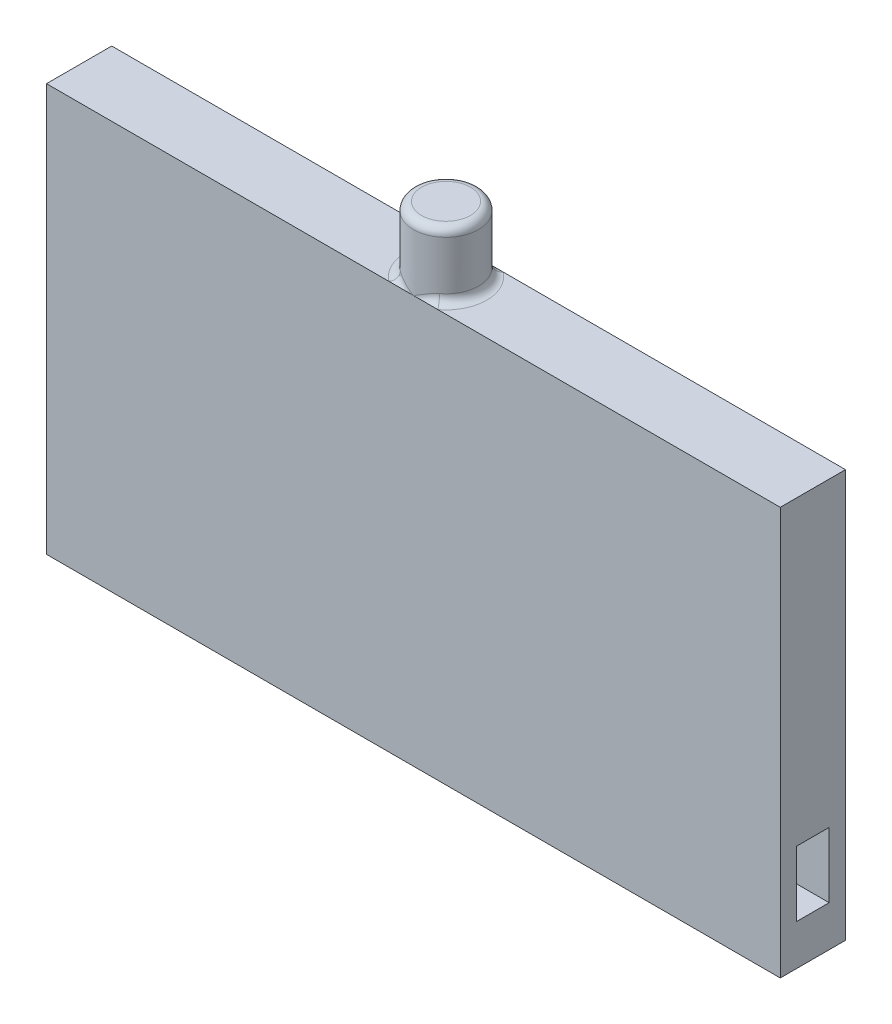
ISO-10303-21;
HEADER;
FILE_DESCRIPTION(('STEP AP214'),'2;1');
FILE_NAME('part.step','',(''),(''),'','','');
FILE_SCHEMA(('AUTOMOTIVE_DESIGN { 1 0 10303 214 1 1 1 1 }'));
ENDSEC;
DATA;
#1=APPLICATION_CONTEXT('core data for automotive mechanical design processes');
#2=APPLICATION_PROTOCOL_DEFINITION('international standard','automotive_design',2000,#1);
#3=PRODUCT_CONTEXT('',#1,'mechanical');
#4=PRODUCT('Part','Part','',(#3));
#5=PRODUCT_RELATED_PRODUCT_CATEGORY('part','',(#4));
#6=PRODUCT_DEFINITION_FORMATION('','',#4);
#7=PRODUCT_DEFINITION_CONTEXT('part definition',#1,'design');
#8=PRODUCT_DEFINITION('design','',#6,#7);
#9=PRODUCT_DEFINITION_SHAPE('','',#8);
#10=(LENGTH_UNIT() NAMED_UNIT(*) SI_UNIT(.MILLI.,.METRE.));
#11=(NAMED_UNIT(*) PLANE_ANGLE_UNIT() SI_UNIT($,.RADIAN.));
#12=(NAMED_UNIT(*) SI_UNIT($,.STERADIAN.) SOLID_ANGLE_UNIT());
#13=UNCERTAINTY_MEASURE_WITH_UNIT(LENGTH_MEASURE(1.E-05),#10,'distance_accuracy_value','');
#14=(GEOMETRIC_REPRESENTATION_CONTEXT(3) GLOBAL_UNCERTAINTY_ASSIGNED_CONTEXT((#13)) GLOBAL_UNIT_ASSIGNED_CONTEXT((#10,
#11,#12)) REPRESENTATION_CONTEXT('',''));
#15=CARTESIAN_POINT('',(0.,0.,0.));
#16=DIRECTION('',(0.,0.,1.));
#17=DIRECTION('',(1.,0.,0.));
#18=AXIS2_PLACEMENT_3D('',#15,#16,#17);
#19=CARTESIAN_POINT('',(0.,12.7,0.));
#20=DIRECTION('',(0.,-1.,0.));
#21=DIRECTION('',(0.,0.,-1.));
#22=AXIS2_PLACEMENT_3D('',#19,#20,#21);
#23=PLANE('',#22);
#24=DIRECTION('',(-1.,0.,0.));
#25=VECTOR('',#24,1.);
#26=CARTESIAN_POINT('',(-9.906,12.7,-15.7398333107177));
#27=LINE('',#26,#25);
#28=CARTESIAN_POINT('',(12.954,12.7,-15.7398333107177));
#29=VERTEX_POINT('',#28);
#30=CARTESIAN_POINT('',(2.286,12.7,-15.7398333107177));
#31=VERTEX_POINT('',#30);
#32=EDGE_CURVE('E192',#29,#31,#27,.T.);
#33=ORIENTED_EDGE('',*,*,#32,.T.);
#34=CARTESIAN_POINT('',(1.524,12.7,-14.7238333107177));
#35=DIRECTION('',(0.,-1.,0.));
#36=DIRECTION('',(0.,0.,-1.));
#37=AXIS2_PLACEMENT_3D('',#34,#35,#36);
#38=CIRCLE('',#37,1.27);
#39=CARTESIAN_POINT('',(2.286,12.7,-13.7078333107177));
#40=VERTEX_POINT('',#39);
#41=EDGE_CURVE('E11',#31,#40,#38,.T.);
#42=ORIENTED_EDGE('',*,*,#41,.T.);
#43=DIRECTION('',(1.,0.,0.));
#44=VECTOR('',#43,1.);
#45=CARTESIAN_POINT('',(-9.906,12.7,-13.7078333107177));
#46=LINE('',#45,#44);
#47=CARTESIAN_POINT('',(12.954,12.7,-13.7078333107177));
#48=VERTEX_POINT('',#47);
#49=EDGE_CURVE('E182',#40,#48,#46,.T.);
#50=ORIENTED_EDGE('',*,*,#49,.T.);
#51=DIRECTION('',(0.,0.,-1.));
#52=VECTOR('',#51,1.);
#53=CARTESIAN_POINT('',(12.954,12.7,-13.7078333107177));
#54=LINE('',#53,#52);
#55=EDGE_CURVE('E187',#48,#29,#54,.T.);
#56=ORIENTED_EDGE('',*,*,#55,.T.);
#57=EDGE_LOOP('',(#33,#42,#50,#56));
#58=FACE_BOUND('',#57,.T.);
#59=ADVANCED_FACE('F38',(#58),#23,.F.);
#60=CARTESIAN_POINT('',(-9.906,12.7,-13.7078333107177));
#61=DIRECTION('',(1.,0.,0.));
#62=DIRECTION('',(0.,0.,-1.));
#63=AXIS2_PLACEMENT_3D('',#60,#61,#62);
#64=PLANE('',#63);
#65=DIRECTION('',(0.,0.,1.));
#66=VECTOR('',#65,1.);
#67=CARTESIAN_POINT('',(-9.906,0.,-13.7078333107177));
#68=LINE('',#67,#66);
#69=CARTESIAN_POINT('',(-9.906,0.,-15.7398333107177));
#70=VERTEX_POINT('',#69);
#71=CARTESIAN_POINT('',(-9.906,0.,-13.7078333107177));
#72=VERTEX_POINT('',#71);
#73=EDGE_CURVE('E196',#70,#72,#68,.T.);
#74=ORIENTED_EDGE('',*,*,#73,.T.);
#75=DIRECTION('',(0.,-1.,0.));
#76=VECTOR('',#75,1.);
#77=CARTESIAN_POINT('',(-9.906,12.7,-13.7078333107177));
#78=LINE('',#77,#76);
#79=CARTESIAN_POINT('',(-9.906,12.7,-13.7078333107177));
#80=VERTEX_POINT('',#79);
#81=EDGE_CURVE('E213',#80,#72,#78,.T.);
#82=ORIENTED_EDGE('',*,*,#81,.F.);
#83=DIRECTION('',(0.,0.,1.));
#84=VECTOR('',#83,1.);
#85=CARTESIAN_POINT('',(-9.906,12.7,-13.7078333107177));
#86=LINE('',#85,#84);
#87=CARTESIAN_POINT('',(-9.906,12.7,-15.7398333107177));
#88=VERTEX_POINT('',#87);
#89=EDGE_CURVE('E179',#88,#80,#86,.T.);
#90=ORIENTED_EDGE('',*,*,#89,.F.);
#91=DIRECTION('',(0.,-1.,0.));
#92=VECTOR('',#91,1.);
#93=CARTESIAN_POINT('',(-9.906,12.7,-15.7398333107177));
#94=LINE('',#93,#92);
#95=EDGE_CURVE('E194',#88,#70,#94,.T.);
#96=ORIENTED_EDGE('',*,*,#95,.T.);
#97=EDGE_LOOP('',(#74,#82,#90,#96));
#98=FACE_BOUND('',#97,.T.);
#99=ADVANCED_FACE('F290',(#98),#64,.F.);
#100=CARTESIAN_POINT('',(-9.906,12.7,-13.7078333107177));
#101=DIRECTION('',(0.,0.,-1.));
#102=DIRECTION('',(-1.,0.,0.));
#103=AXIS2_PLACEMENT_3D('',#100,#101,#102);
#104=PLANE('',#103);
#105=DIRECTION('',(1.,0.,0.));
#106=VECTOR('',#105,1.);
#107=CARTESIAN_POINT('',(-9.906,0.,-13.7078333107177));
#108=LINE('',#107,#106);
#109=CARTESIAN_POINT('',(12.954,0.,-13.7078333107177));
#110=VERTEX_POINT('',#109);
#111=EDGE_CURVE('E199',#72,#110,#108,.T.);
#112=ORIENTED_EDGE('',*,*,#111,.T.);
#113=DIRECTION('',(0.,-1.,0.));
#114=VECTOR('',#113,1.);
#115=CARTESIAN_POINT('',(12.954,12.7,-13.7078333107177));
#116=LINE('',#115,#114);
#117=EDGE_CURVE('E210',#48,#110,#116,.T.);
#118=ORIENTED_EDGE('',*,*,#117,.F.);
#119=ORIENTED_EDGE('',*,*,#49,.F.);
#120=CARTESIAN_POINT('',(1.524,12.7,-13.7078333107177));
#121=VERTEX_POINT('',#120);
#122=EDGE_CURVE('E189',#121,#40,#46,.T.);
#123=ORIENTED_EDGE('',*,*,#122,.F.);
#124=CARTESIAN_POINT('',(0.762000000000002,12.7,-13.7078333107177));
#125=VERTEX_POINT('',#124);
#126=EDGE_CURVE('E188',#125,#121,#46,.T.);
#127=ORIENTED_EDGE('',*,*,#126,.F.);
#128=EDGE_CURVE('E184',#80,#125,#46,.T.);
#129=ORIENTED_EDGE('',*,*,#128,.F.);
#130=ORIENTED_EDGE('',*,*,#81,.T.);
#131=EDGE_LOOP('',(#112,#118,#119,#123,#127,#129,#130));
#132=FACE_BOUND('',#131,.T.);
#133=ADVANCED_FACE('F286',(#132),#104,.F.);
#134=CARTESIAN_POINT('',(12.954,12.7,-13.7078333107177));
#135=DIRECTION('',(-1.,0.,0.));
#136=DIRECTION('',(0.,0.,1.));
#137=AXIS2_PLACEMENT_3D('',#134,#135,#136);
#138=PLANE('',#137);
#139=DIRECTION('',(0.,0.,-1.));
#140=VECTOR('',#139,1.);
#141=CARTESIAN_POINT('',(12.954,1.27,-14.2158333107177));
#142=LINE('',#141,#140);
#143=CARTESIAN_POINT('',(12.954,1.27,-14.2158333107177));
#144=VERTEX_POINT('',#143);
#145=CARTESIAN_POINT('',(12.954,1.27,-15.2318333107177));
#146=VERTEX_POINT('',#145);
#147=EDGE_CURVE('E169',#144,#146,#142,.T.);
#148=ORIENTED_EDGE('',*,*,#147,.F.);
#149=DIRECTION('',(0.,-1.,0.));
#150=VECTOR('',#149,1.);
#151=CARTESIAN_POINT('',(12.954,1.27,-14.2158333107177));
#152=LINE('',#151,#150);
#153=CARTESIAN_POINT('',(12.954,3.302,-14.2158333107177));
#154=VERTEX_POINT('',#153);
#155=EDGE_CURVE('E59',#154,#144,#152,.T.);
#156=ORIENTED_EDGE('',*,*,#155,.F.);
#157=DIRECTION('',(0.,0.,1.));
#158=VECTOR('',#157,1.);
#159=CARTESIAN_POINT('',(12.954,3.302,-14.2158333107177));
#160=LINE('',#159,#158);
#161=CARTESIAN_POINT('',(12.954,3.302,-15.2318333107177));
#162=VERTEX_POINT('',#161);
#163=EDGE_CURVE('E160',#162,#154,#160,.T.);
#164=ORIENTED_EDGE('',*,*,#163,.F.);
#165=DIRECTION('',(0.,1.,0.));
#166=VECTOR('',#165,1.);
#167=CARTESIAN_POINT('',(12.954,1.27,-15.2318333107177));
#168=LINE('',#167,#166);
#169=EDGE_CURVE('E163',#146,#162,#168,.T.);
#170=ORIENTED_EDGE('',*,*,#169,.F.);
#171=EDGE_LOOP('',(#148,#156,#164,#170));
#172=FACE_BOUND('',#171,.T.);
#173=DIRECTION('',(0.,0.,-1.));
#174=VECTOR('',#173,1.);
#175=CARTESIAN_POINT('',(12.954,0.,-13.7078333107177));
#176=LINE('',#175,#174);
#177=CARTESIAN_POINT('',(12.954,0.,-15.7398333107177));
#178=VERTEX_POINT('',#177);
#179=EDGE_CURVE('E202',#110,#178,#176,.T.);
#180=ORIENTED_EDGE('',*,*,#179,.T.);
#181=DIRECTION('',(0.,-1.,0.));
#182=VECTOR('',#181,1.);
#183=CARTESIAN_POINT('',(12.954,12.7,-15.7398333107177));
#184=LINE('',#183,#182);
#185=EDGE_CURVE('E207',#29,#178,#184,.T.);
#186=ORIENTED_EDGE('',*,*,#185,.F.);
#187=ORIENTED_EDGE('',*,*,#55,.F.);
#188=ORIENTED_EDGE('',*,*,#117,.T.);
#189=EDGE_LOOP('',(#180,#186,#187,#188));
#190=FACE_BOUND('',#189,.T.);
#191=ADVANCED_FACE('F289',(#172,#190),#138,.F.);
#192=CARTESIAN_POINT('',(-9.906,12.7,-15.7398333107177));
#193=DIRECTION('',(0.,0.,1.));
#194=DIRECTION('',(1.,0.,0.));
#195=AXIS2_PLACEMENT_3D('',#192,#193,#194);
#196=PLANE('',#195);
#197=DIRECTION('',(-1.,0.,0.));
#198=VECTOR('',#197,1.);
#199=CARTESIAN_POINT('',(-9.906,0.,-15.7398333107177));
#200=LINE('',#199,#198);
#201=EDGE_CURVE('E183',#178,#70,#200,.T.);
#202=ORIENTED_EDGE('',*,*,#201,.T.);
#203=ORIENTED_EDGE('',*,*,#95,.F.);
#204=CARTESIAN_POINT('',(0.762000000000002,12.7,-15.7398333107177));
#205=VERTEX_POINT('',#204);
#206=EDGE_CURVE('E191',#205,#88,#27,.T.);
#207=ORIENTED_EDGE('',*,*,#206,.F.);
#208=CARTESIAN_POINT('',(1.524,12.7,-15.7398333107177));
#209=VERTEX_POINT('',#208);
#210=EDGE_CURVE('E195',#209,#205,#27,.T.);
#211=ORIENTED_EDGE('',*,*,#210,.F.);
#212=EDGE_CURVE('E67',#31,#209,#27,.T.);
#213=ORIENTED_EDGE('',*,*,#212,.F.);
#214=ORIENTED_EDGE('',*,*,#32,.F.);
#215=ORIENTED_EDGE('',*,*,#185,.T.);
#216=EDGE_LOOP('',(#202,#203,#207,#211,#213,#214,#215));
#217=FACE_BOUND('',#216,.T.);
#218=ADVANCED_FACE('F260',(#217),#196,.F.);
#219=ORIENTED_EDGE('',*,*,#128,.T.);
#220=CARTESIAN_POINT('',(1.524,12.7,-14.7238333107177));
#221=DIRECTION('',(0.,-1.,0.));
#222=DIRECTION('',(0.,0.,-1.));
#223=AXIS2_PLACEMENT_3D('',#220,#221,#222);
#224=CIRCLE('',#223,1.27);
#225=EDGE_CURVE('E51',#125,#205,#224,.T.);
#226=ORIENTED_EDGE('',*,*,#225,.T.);
#227=ORIENTED_EDGE('',*,*,#206,.T.);
#228=ORIENTED_EDGE('',*,*,#89,.T.);
#229=EDGE_LOOP('',(#219,#226,#227,#228));
#230=FACE_BOUND('',#229,.T.);
#231=ADVANCED_FACE('F257',(#230),#23,.F.);
#232=CARTESIAN_POINT('',(0.,0.,0.));
#233=DIRECTION('',(0.,-1.,0.));
#234=DIRECTION('',(0.,0.,-1.));
#235=AXIS2_PLACEMENT_3D('',#232,#233,#234);
#236=PLANE('',#235);
#237=ORIENTED_EDGE('',*,*,#73,.F.);
#238=ORIENTED_EDGE('',*,*,#201,.F.);
#239=ORIENTED_EDGE('',*,*,#179,.F.);
#240=ORIENTED_EDGE('',*,*,#111,.F.);
#241=EDGE_LOOP('',(#237,#238,#239,#240));
#242=FACE_BOUND('',#241,.T.);
#243=ADVANCED_FACE('F382',(#242),#236,.T.);
#244=CARTESIAN_POINT('',(1.524,14.732,-14.7238333107177));
#245=DIRECTION('',(0.,-1.,0.));
#246=DIRECTION('',(0.,0.,-1.));
#247=AXIS2_PLACEMENT_3D('',#244,#245,#246);
#248=CYLINDRICAL_SURFACE('',#247,1.016);
#249=CARTESIAN_POINT('',(1.524,14.478,-14.7238333107177));
#250=DIRECTION('',(0.,1.,0.));
#251=DIRECTION('',(0.,0.,1.));
#252=AXIS2_PLACEMENT_3D('',#249,#250,#251);
#253=CIRCLE('',#252,1.016);
#254=CARTESIAN_POINT('',(1.524,14.478,-13.7078333107177));
#255=VERTEX_POINT('',#254);
#256=EDGE_CURVE('E219',#255,#255,#253,.F.);
#257=ORIENTED_EDGE('',*,*,#256,.T.);
#258=EDGE_LOOP('',(#257));
#259=FACE_BOUND('',#258,.T.);
#260=CARTESIAN_POINT('',(2.22999399919304,12.9323092693618,-15.4544689744403));
#261=CARTESIAN_POINT('',(2.15762912961619,12.6047525616474,-15.5243932420477));
#262=CARTESIAN_POINT('',(2.4064924989913,12.7,-15.7398333107177));
#263=CARTESIAN_POINT('',(2.21539070176302,12.9400643662147,-15.4686076936029));
#264=CARTESIAN_POINT('',(2.16013043971291,12.6217760831303,-15.5193105706868));
#265=CARTESIAN_POINT('',(2.38823837720513,12.7,-15.7398333107177));
#266=CARTESIAN_POINT('',(2.20002251066382,12.9454546331779,-15.4825825451088));
#267=CARTESIAN_POINT('',(2.15898944492113,12.6391526553524,-15.5187327865888));
#268=CARTESIAN_POINT('',(2.36902813833045,12.7,-15.7398333107177));
#269=CARTESIAN_POINT('',(2.16829395448067,12.9523528845866,-15.5096839311462));
#270=CARTESIAN_POINT('',(2.1506264079769,12.6710582418321,-15.5237704354303));
#271=CARTESIAN_POINT('',(2.32936744310018,12.7,-15.7398333107177));
#272=CARTESIAN_POINT('',(2.15194579597119,12.9539013090713,-15.5228178720088));
#273=CARTESIAN_POINT('',(2.14378702017022,12.685768224025,-15.5289959824419));
#274=CARTESIAN_POINT('',(2.30893224496265,12.7,-15.7398333107177));
#275=CARTESIAN_POINT('',(2.10900747699933,12.9541429622308,-15.5551591211067));
#276=CARTESIAN_POINT('',(2.12080212618187,12.7179163845327,-15.5462268347036));
#277=CARTESIAN_POINT('',(2.25525934625124,12.7,-15.7398333107177));
#278=CARTESIAN_POINT('',(2.0818524305337,12.9507269739582,-15.573601893695));
#279=CARTESIAN_POINT('',(2.10163664566155,12.7335982565379,-15.5603817747969));
#280=CARTESIAN_POINT('',(2.22131553817615,12.7,-15.7398333107177));
#281=CARTESIAN_POINT('',(2.02626390275384,12.939025664532,-15.607609498478));
#282=CARTESIAN_POINT('',(2.05682597770893,12.75617974827,-15.5899736995301));
#283=CARTESIAN_POINT('',(2.15182987843322,12.7,-15.7398333107177));
#284=CARTESIAN_POINT('',(1.99782272973763,12.9307060312762,-15.6231530248784));
#285=CARTESIAN_POINT('',(2.03128975608147,12.7636517012701,-15.605494761524));
#286=CARTESIAN_POINT('',(2.11627841213767,12.7,-15.7398333107177));
#287=CARTESIAN_POINT('',(1.92328672816379,12.904866876462,-15.6594677944974));
#288=CARTESIAN_POINT('',(1.9614353813307,12.774387062972,-15.6428992688062));
#289=CARTESIAN_POINT('',(2.02310841025931,12.7,-15.7398333107177));
#290=CARTESIAN_POINT('',(1.87663894934852,12.8848140642996,-15.6779437854235));
#291=CARTESIAN_POINT('',(1.91305433596181,12.7738815954522,-15.6646704824849));
#292=CARTESIAN_POINT('',(1.96479868694514,12.7,-15.7398333107177));
#293=CARTESIAN_POINT('',(1.78258626727586,12.8402683605976,-15.7076154347474));
#294=CARTESIAN_POINT('',(1.81312650696352,12.7638351499827,-15.6996887709867));
#295=CARTESIAN_POINT('',(1.84723283436228,12.7,-15.7398333107177));
#296=CARTESIAN_POINT('',(1.73518191506025,12.8157785771441,-15.718816164421));
#297=CARTESIAN_POINT('',(1.76064846188578,12.7545968557819,-15.7137001602763));
#298=CARTESIAN_POINT('',(1.78797739389608,12.7,-15.7398333107177));
#299=CARTESIAN_POINT('',(1.63492660571583,12.7619811321778,-15.7351642232897));
#300=CARTESIAN_POINT('',(1.6495216086822,12.7311085861398,-15.733821241473));
#301=CARTESIAN_POINT('',(1.66265825706662,12.7,-15.7398333107177));
#302=CARTESIAN_POINT('',(1.58202795947278,12.7324377091468,-15.7395495368551));
#303=CARTESIAN_POINT('',(1.5893044812909,12.716222578597,-15.7394740322518));
#304=CARTESIAN_POINT('',(1.59653494933849,12.7,-15.7398333107177));
#305=CARTESIAN_POINT('',(1.52747000556191,12.7019397824138,-15.7398288607023));
#306=CARTESIAN_POINT('',(1.52790377917589,12.7009699098801,-15.7398278934925));
#307=CARTESIAN_POINT('',(1.52833750695247,12.7,-15.7398333107177));
#308=CARTESIAN_POINT('',(1.52573495587471,12.70096985959,-15.7398333042165));
#309=CARTESIAN_POINT('',(1.52595182230564,12.7004849426041,-15.7398334575026));
#310=CARTESIAN_POINT('',(1.52616869484347,12.7,-15.7398333107177));
#311=CARTESIAN_POINT('',(1.524,12.7,-15.7398333107177));
#312=CARTESIAN_POINT('',(1.524,12.7,-15.7398333107177));
#313=CARTESIAN_POINT('',(1.524,12.7,-15.7398333107177));
#314=(BOUNDED_SURFACE() B_SPLINE_SURFACE(3,2,((#260,#261,#262),(#263,#264,#265),(#266,#267,
#268),(#269,#270,#271),(#272,#273,#274),(#275,#276,#277),(#278,#279,#280),(#281,#282,#283),
(#284,#285,#286),(#287,#288,#289),(#290,#291,#292),(#293,#294,#295),(#296,#297,#298),(#299,#300,
#301),(#302,#303,#304),(#305,#306,#307),(#308,#309,#310),(#311,#312,#313)),.UNSPECIFIED.,.F.,
.F.,.F.) B_SPLINE_SURFACE_WITH_KNOTS((4,2,2,2,2,2,2,2,4),(3,3),(0.,0.0793252790118578,
0.157811952154223,0.280673172074431,0.404404464946702,0.600842987831006,0.797144434390673,
1.01412570681678,1.02125313817637),(0.,1.),
.UNSPECIFIED.) GEOMETRIC_REPRESENTATION_ITEM() RATIONAL_B_SPLINE_SURFACE(((1.,0.595490754317653,
1.),(1.,0.614138792536777,1.),(1.,0.632907033109889,1.),(1.,0.669779348387161,1.),(1.,
0.687888346908783,1.),(1.,0.73287636210131,1.),(1.,0.758925185024582,1.),(1.,0.807344062701329,
1.),(1.,0.829686758942298,1.),(1.,0.882140467793232,1.),(1.,0.909101389562458,1.),(1.,
0.952536676117571,1.),(1.,0.969018345376008,1.),(1.,0.993099717373105,1.),(1.,0.999580814566414,
1.),(1.,0.999993437605627,1.),(1.,0.999999998399152,1.),(1.,1.,1.))) REPRESENTATION_ITEM('') SURFACE());
#315=CARTESIAN_POINT('',(2.22999399919304,12.9323092693618,-15.4544689744403));
#316=CARTESIAN_POINT('',(2.21539070176302,12.9400643662147,-15.4686076936029));
#317=CARTESIAN_POINT('',(2.20002251066382,12.9454546331779,-15.4825825451088));
#318=CARTESIAN_POINT('',(2.16829395448067,12.9523528845866,-15.5096839311462));
#319=CARTESIAN_POINT('',(2.15194579597118,12.9539013090713,-15.5228178720088));
#320=CARTESIAN_POINT('',(2.10900747699933,12.9541429622308,-15.5551591211067));
#321=CARTESIAN_POINT('',(2.0818524305337,12.9507269739582,-15.573601893695));
#322=CARTESIAN_POINT('',(2.02626390275384,12.939025664532,-15.607609498478));
#323=CARTESIAN_POINT('',(1.99782272973763,12.9307060312762,-15.6231530248784));
#324=CARTESIAN_POINT('',(1.92328672816379,12.904866876462,-15.6594677944974));
#325=CARTESIAN_POINT('',(1.87663894934852,12.8848140642996,-15.6779437854235));
#326=CARTESIAN_POINT('',(1.78258626727586,12.8402683605976,-15.7076154347474));
#327=CARTESIAN_POINT('',(1.73518191506025,12.8157785771441,-15.718816164421));
#328=CARTESIAN_POINT('',(1.63492660571583,12.7619811321777,-15.7351642232897));
#329=CARTESIAN_POINT('',(1.58202795947279,12.7324377091468,-15.7395495368551));
#330=CARTESIAN_POINT('',(1.52747000556191,12.7019397824138,-15.7398288607023));
#331=CARTESIAN_POINT('',(1.5257349558747,12.70096985959,-15.7398333042165));
#332=CARTESIAN_POINT('',(1.524,12.7,-15.7398333107177));
#333=B_SPLINE_CURVE_WITH_KNOTS('',3,(#315,#316,#317,#318,#319,#320,#321,#322,#323,#324,#325,
#326,#327,#328,#329,#330,#331,#332),.UNSPECIFIED.,.F.,.F.,(4,2,2,2,2,2,2,2,4),(0.,
0.0793252790118578,0.157811952154223,0.280673172074431,0.404404464946702,0.600842987831006,
0.797144434390673,1.01412570681678,1.02125313817637),.UNSPECIFIED.);
#334=CARTESIAN_POINT('',(2.1336,12.954,-15.5366333107177));
#335=VERTEX_POINT('',#334);
#336=EDGE_CURVE('E222',#335,#209,#333,.T.);
#337=ORIENTED_EDGE('',*,*,#336,.T.);
#338=CARTESIAN_POINT('',(0.641507501008595,12.7,-15.7398333107177));
#339=CARTESIAN_POINT('',(0.890370870383829,12.6047525616473,-15.5243932420477));
#340=CARTESIAN_POINT('',(0.818006000806876,12.9323092693617,-15.4544689744402));
#341=CARTESIAN_POINT('',(0.659761622794754,12.7,-15.7398333107177));
#342=CARTESIAN_POINT('',(0.887869560287096,12.6217760831301,-15.5193105706868));
#343=CARTESIAN_POINT('',(0.832609298236888,12.9400643662146,-15.4686076936028));
#344=CARTESIAN_POINT('',(0.678971861669423,12.7,-15.7398333107177));
#345=CARTESIAN_POINT('',(0.889010555078859,12.6391526553522,-15.5187327865888));
#346=CARTESIAN_POINT('',(0.847977489336078,12.9454546331779,-15.4825825451087));
#347=CARTESIAN_POINT('',(0.718632556899669,12.7,-15.7398333107177));
#348=CARTESIAN_POINT('',(0.897373592023053,12.671058241832,-15.5237704354303));
#349=CARTESIAN_POINT('',(0.879706045519202,12.9523528845866,-15.5096839311461));
#350=CARTESIAN_POINT('',(0.739067755037179,12.7,-15.7398333107177));
#351=CARTESIAN_POINT('',(0.904212979829715,12.6857682240248,-15.5289959824419));
#352=CARTESIAN_POINT('',(0.896054204028682,12.9539013090713,-15.5228178720087));
#353=CARTESIAN_POINT('',(0.792740653748561,12.7,-15.7398333107177));
#354=CARTESIAN_POINT('',(0.927197873818024,12.7179163845326,-15.5462268347036));
#355=CARTESIAN_POINT('',(0.938992523000511,12.9541429622308,-15.5551591211065));
#356=CARTESIAN_POINT('',(0.826684461823625,12.7,-15.7398333107177));
#357=CARTESIAN_POINT('',(0.946363354338319,12.7335982565378,-15.5603817747968));
#358=CARTESIAN_POINT('',(0.966147569466119,12.9507269739582,-15.5736018936949));
#359=CARTESIAN_POINT('',(0.896170121566516,12.7,-15.7398333107177));
#360=CARTESIAN_POINT('',(0.991174022290886,12.7561797482699,-15.58997369953));
#361=CARTESIAN_POINT('',(1.02173609724594,12.939025664532,-15.6076094984778));
#362=CARTESIAN_POINT('',(0.931721587862042,12.7,-15.7398333107177));
#363=CARTESIAN_POINT('',(1.01671024391832,12.76365170127,-15.6054947615239));
#364=CARTESIAN_POINT('',(1.05017727026214,12.9307060312763,-15.6231530248783));
#365=CARTESIAN_POINT('',(1.02489158974034,12.7,-15.7398333107177));
#366=CARTESIAN_POINT('',(1.08656461866902,12.774387062972,-15.6428992688061));
#367=CARTESIAN_POINT('',(1.12471327183593,12.9048668764621,-15.6594677944973));
#368=CARTESIAN_POINT('',(1.08320131305448,12.7,-15.7398333107177));
#369=CARTESIAN_POINT('',(1.13494566403788,12.7738815954522,-15.6646704824848));
#370=CARTESIAN_POINT('',(1.17136105065118,12.8848140642998,-15.6779437854234));
#371=CARTESIAN_POINT('',(1.20076716563728,12.7,-15.7398333107177));
#372=CARTESIAN_POINT('',(1.2348734930361,12.7638351499827,-15.6996887709866));
#373=CARTESIAN_POINT('',(1.26541373272379,12.8402683605977,-15.7076154347473));
#374=CARTESIAN_POINT('',(1.26002260610345,12.7,-15.7398333107177));
#375=CARTESIAN_POINT('',(1.28735153811381,12.7545968557819,-15.7137001602762));
#376=CARTESIAN_POINT('',(1.31281808493937,12.8157785771443,-15.7188161644209));
#377=CARTESIAN_POINT('',(1.38534174293305,12.7,-15.7398333107177));
#378=CARTESIAN_POINT('',(1.39847839131749,12.7311085861399,-15.733821241473));
#379=CARTESIAN_POINT('',(1.4130733942839,12.7619811321779,-15.7351642232897));
#380=CARTESIAN_POINT('',(1.45146505066133,12.7,-15.7398333107177));
#381=CARTESIAN_POINT('',(1.45869551870895,12.7162225785971,-15.7394740322518));
#382=CARTESIAN_POINT('',(1.46597204052708,12.7324377091469,-15.7395495368551));
#383=CARTESIAN_POINT('',(1.51966249304753,12.7,-15.7398333107177));
#384=CARTESIAN_POINT('',(1.52009622082411,12.7009699098801,-15.7398278934925));
#385=CARTESIAN_POINT('',(1.52052999443809,12.7019397824138,-15.7398288607023));
#386=CARTESIAN_POINT('',(1.52183130515654,12.7,-15.7398333107177));
#387=CARTESIAN_POINT('',(1.52204817769436,12.7004849426041,-15.7398334575026));
#388=CARTESIAN_POINT('',(1.5222650441253,12.70096985959,-15.7398333042165));
#389=CARTESIAN_POINT('',(1.524,12.7,-15.7398333107177));
#390=CARTESIAN_POINT('',(1.524,12.7,-15.7398333107177));
#391=CARTESIAN_POINT('',(1.524,12.7,-15.7398333107177));
#392=(BOUNDED_SURFACE() B_SPLINE_SURFACE(3,2,((#338,#339,#340),(#341,#342,#343),(#344,#345,
#346),(#347,#348,#349),(#350,#351,#352),(#353,#354,#355),(#356,#357,#358),(#359,#360,#361),
(#362,#363,#364),(#365,#366,#367),(#368,#369,#370),(#371,#372,#373),(#374,#375,#376),(#377,#378,
#379),(#380,#381,#382),(#383,#384,#385),(#386,#387,#388),(#389,#390,#391)),.UNSPECIFIED.,.F.,
.F.,.F.) B_SPLINE_SURFACE_WITH_KNOTS((4,2,2,2,2,2,2,2,4),(3,3),(0.,0.0793252790118214,
0.157811952154154,0.280673172074297,0.404404464946499,0.600842987830704,0.797144434390273,
1.01412570681693,1.02125313817652),(0.,1.),
.UNSPECIFIED.) GEOMETRIC_REPRESENTATION_ITEM() RATIONAL_B_SPLINE_SURFACE(((1.,0.595490754317544,
1.),(1.,0.614138792536657,1.),(1.,0.63290703310976,1.),(1.,0.669779348387018,1.),(1.,
0.687888346908636,1.),(1.,0.73287636210115,1.),(1.,0.758925185024416,1.),(1.,0.807344062701154,
1.),(1.,0.82968675894212,1.),(1.,0.882140467793057,1.),(1.,0.909101389562292,1.),(1.,
0.952536676117432,1.),(1.,0.969018345375888,1.),(1.,0.993099717373071,1.),(1.,0.999580814566413,
1.),(1.,0.999993437605627,1.),(1.,0.999999998399152,1.),(1.,1.,1.))) REPRESENTATION_ITEM('') SURFACE());
#393=CARTESIAN_POINT('',(0.818006000806876,12.9323092693617,-15.4544689744402));
#394=CARTESIAN_POINT('',(0.832609298236888,12.9400643662146,-15.4686076936028));
#395=CARTESIAN_POINT('',(0.847977489336078,12.9454546331779,-15.4825825451087));
#396=CARTESIAN_POINT('',(0.879706045519202,12.9523528845866,-15.5096839311461));
#397=CARTESIAN_POINT('',(0.896054204028682,12.9539013090713,-15.5228178720087));
#398=CARTESIAN_POINT('',(0.938992523000511,12.9541429622308,-15.5551591211065));
#399=CARTESIAN_POINT('',(0.966147569466119,12.9507269739582,-15.5736018936949));
#400=CARTESIAN_POINT('',(1.02173609724594,12.939025664532,-15.6076094984778));
#401=CARTESIAN_POINT('',(1.05017727026214,12.9307060312763,-15.6231530248783));
#402=CARTESIAN_POINT('',(1.12471327183593,12.9048668764621,-15.6594677944973));
#403=CARTESIAN_POINT('',(1.17136105065118,12.8848140642998,-15.6779437854234));
#404=CARTESIAN_POINT('',(1.26541373272379,12.8402683605977,-15.7076154347473));
#405=CARTESIAN_POINT('',(1.31281808493937,12.8157785771443,-15.7188161644209));
#406=CARTESIAN_POINT('',(1.4130733942839,12.7619811321779,-15.7351642232897));
#407=CARTESIAN_POINT('',(1.46597204052708,12.7324377091469,-15.7395495368551));
#408=CARTESIAN_POINT('',(1.52052999443809,12.7019397824138,-15.7398288607023));
#409=CARTESIAN_POINT('',(1.5222650441253,12.70096985959,-15.7398333042165));
#410=CARTESIAN_POINT('',(1.524,12.7,-15.7398333107177));
#411=B_SPLINE_CURVE_WITH_KNOTS('',3,(#393,#394,#395,#396,#397,#398,#399,#400,#401,#402,#403,
#404,#405,#406,#407,#408,#409,#410),.UNSPECIFIED.,.F.,.F.,(4,2,2,2,2,2,2,2,4),(0.,
0.0793252790118214,0.157811952154154,0.280673172074297,0.404404464946499,0.600842987830704,
0.797144434390273,1.01412570681693,1.02125313817652),.UNSPECIFIED.);
#412=CARTESIAN_POINT('',(0.914400000000002,12.954,-15.5366333107177));
#413=VERTEX_POINT('',#412);
#414=EDGE_CURVE('E345',#209,#413,#411,.F.);
#415=ORIENTED_EDGE('',*,*,#414,.T.);
#416=CARTESIAN_POINT('',(1.524,12.954,-14.7238333107177));
#417=DIRECTION('',(0.,-1.,0.));
#418=DIRECTION('',(0.,0.,-1.));
#419=AXIS2_PLACEMENT_3D('',#416,#417,#418);
#420=CIRCLE('',#419,1.016);
#421=CARTESIAN_POINT('',(0.914400000000002,12.954,-13.9110333107177));
#422=VERTEX_POINT('',#421);
#423=EDGE_CURVE('E327',#413,#422,#420,.F.);
#424=ORIENTED_EDGE('',*,*,#423,.T.);
#425=CARTESIAN_POINT('',(0.818006000806964,12.9323092693618,-13.993197646995));
#426=CARTESIAN_POINT('',(0.890370870383815,12.6047525616474,-13.9232733793877));
#427=CARTESIAN_POINT('',(0.641507501008704,12.7,-13.7078333107177));
#428=CARTESIAN_POINT('',(0.832609298236986,12.9400643662147,-13.9790589278324));
#429=CARTESIAN_POINT('',(0.887869560287094,12.6217760831302,-13.9283560507486));
#430=CARTESIAN_POINT('',(0.659761622794876,12.7,-13.7078333107177));
#431=CARTESIAN_POINT('',(0.847977489336187,12.9454546331779,-13.9650840763265));
#432=CARTESIAN_POINT('',(0.889010555078872,12.6391526553524,-13.9289338348466));
#433=CARTESIAN_POINT('',(0.678971861669559,12.7,-13.7078333107177));
#434=CARTESIAN_POINT('',(0.879706045519332,12.9523528845866,-13.9379826902891));
#435=CARTESIAN_POINT('',(0.8973735920231,12.6710582418321,-13.9238961860051));
#436=CARTESIAN_POINT('',(0.718632556899832,12.7,-13.7078333107177));
#437=CARTESIAN_POINT('',(0.896054204028822,12.9539013090713,-13.9248487494266));
#438=CARTESIAN_POINT('',(0.90421297982978,12.685768224025,-13.9186706389934));
#439=CARTESIAN_POINT('',(0.739067755037355,12.7,-13.7078333107177));
#440=CARTESIAN_POINT('',(0.93899252300068,12.9541429622308,-13.8925075003287));
#441=CARTESIAN_POINT('',(0.927197873818133,12.7179163845328,-13.9014397867317));
#442=CARTESIAN_POINT('',(0.792740653748772,12.7,-13.7078333107177));
#443=CARTESIAN_POINT('',(0.966147569466305,12.9507269739582,-13.8740647277404));
#444=CARTESIAN_POINT('',(0.946363354338456,12.7335982565379,-13.8872848466385));
#445=CARTESIAN_POINT('',(0.826684461823858,12.7,-13.7078333107177));
#446=CARTESIAN_POINT('',(1.02173609724617,12.939025664532,-13.8400571229574));
#447=CARTESIAN_POINT('',(0.991174022291078,12.75617974827,-13.8576929219053));
#448=CARTESIAN_POINT('',(0.896170121566795,12.7,-13.7078333107177));
#449=CARTESIAN_POINT('',(1.05017727026238,12.9307060312762,-13.8245135965569));
#450=CARTESIAN_POINT('',(1.01671024391854,12.7636517012701,-13.8421718599114));
#451=CARTESIAN_POINT('',(0.931721587862345,12.7,-13.7078333107177));
#452=CARTESIAN_POINT('',(1.12471327183622,12.904866876462,-13.788198826938));
#453=CARTESIAN_POINT('',(1.08656461866931,12.7743870629721,-13.8047673526291));
#454=CARTESIAN_POINT('',(1.0248915897407,12.7,-13.7078333107177));
#455=CARTESIAN_POINT('',(1.1713610506515,12.8848140642996,-13.7697228360118));
#456=CARTESIAN_POINT('',(1.1349456640382,12.7738815954522,-13.7829961389504));
#457=CARTESIAN_POINT('',(1.08320131305487,12.7,-13.7078333107177));
#458=CARTESIAN_POINT('',(1.26541373272416,12.8402683605975,-13.740051186688));
#459=CARTESIAN_POINT('',(1.2348734930365,12.7638351499827,-13.7479778504487));
#460=CARTESIAN_POINT('',(1.20076716563774,12.7,-13.7078333107177));
#461=CARTESIAN_POINT('',(1.31281808493976,12.8157785771441,-13.7288504570144));
#462=CARTESIAN_POINT('',(1.28735153811424,12.7545968557819,-13.733966461159));
#463=CARTESIAN_POINT('',(1.26002260610394,12.7,-13.7078333107177));
#464=CARTESIAN_POINT('',(1.41307339428417,12.7619811321777,-13.7125023981457));
#465=CARTESIAN_POINT('',(1.39847839131781,12.7311085861398,-13.7138453799624));
#466=CARTESIAN_POINT('',(1.38534174293339,12.7,-13.7078333107177));
#467=CARTESIAN_POINT('',(1.46597204052721,12.7324377091468,-13.7081170845803));
#468=CARTESIAN_POINT('',(1.4586955187091,12.716222578597,-13.7081925891836));
#469=CARTESIAN_POINT('',(1.4514650506615,12.7,-13.7078333107177));
#470=CARTESIAN_POINT('',(1.52052999443809,12.7019397824138,-13.7078377607331));
#471=CARTESIAN_POINT('',(1.52009622082411,12.7009699098801,-13.7078387279428));
#472=CARTESIAN_POINT('',(1.51966249304753,12.7,-13.7078333107177));
#473=CARTESIAN_POINT('',(1.5222650441253,12.70096985959,-13.7078333172189));
#474=CARTESIAN_POINT('',(1.52204817769436,12.7004849426041,-13.7078331639328));
#475=CARTESIAN_POINT('',(1.52183130515654,12.7,-13.7078333107177));
#476=CARTESIAN_POINT('',(1.524,12.7,-13.7078333107177));
#477=CARTESIAN_POINT('',(1.524,12.7,-13.7078333107177));
#478=CARTESIAN_POINT('',(1.524,12.7,-13.7078333107177));
#479=(BOUNDED_SURFACE() B_SPLINE_SURFACE(3,2,((#425,#426,#427),(#428,#429,#430),(#431,#432,
#433),(#434,#435,#436),(#437,#438,#439),(#440,#441,#442),(#443,#444,#445),(#446,#447,#448),
(#449,#450,#451),(#452,#453,#454),(#455,#456,#457),(#458,#459,#460),(#461,#462,#463),(#464,#465,
#466),(#467,#468,#469),(#470,#471,#472),(#473,#474,#475),(#476,#477,#478)),.UNSPECIFIED.,.F.,
.F.,.F.) B_SPLINE_SURFACE_WITH_KNOTS((4,2,2,2,2,2,2,2,4),(3,3),(0.,0.0793252790118616,
0.15781195215423,0.28067317207444,0.404404464946713,0.600842987831021,0.797144434390689,
1.01412570681677,1.02125313817637),(0.,1.),
.UNSPECIFIED.) GEOMETRIC_REPRESENTATION_ITEM() RATIONAL_B_SPLINE_SURFACE(((1.,0.595490754317655,
1.),(1.,0.614138792536779,1.),(1.,0.632907033109892,1.),(1.,0.669779348387165,1.),(1.,
0.687888346908788,1.),(1.,0.732876362101316,1.),(1.,0.75892518502459,1.),(1.,0.807344062701337,
1.),(1.,0.829686758942304,1.),(1.,0.882140467793236,1.),(1.,0.909101389562463,1.),(1.,
0.952536676117575,1.),(1.,0.969018345376012,1.),(1.,0.993099717373106,1.),(1.,0.999580814566414,
1.),(1.,0.999993437605627,1.),(1.,0.999999998399152,1.),(1.,1.,1.))) REPRESENTATION_ITEM('') SURFACE());
#480=CARTESIAN_POINT('',(0.818006000806964,12.9323092693618,-13.993197646995));
#481=CARTESIAN_POINT('',(0.832609298236986,12.9400643662147,-13.9790589278324));
#482=CARTESIAN_POINT('',(0.847977489336187,12.9454546331779,-13.9650840763265));
#483=CARTESIAN_POINT('',(0.879706045519332,12.9523528845866,-13.9379826902891));
#484=CARTESIAN_POINT('',(0.896054204028822,12.9539013090713,-13.9248487494266));
#485=CARTESIAN_POINT('',(0.93899252300068,12.9541429622308,-13.8925075003287));
#486=CARTESIAN_POINT('',(0.966147569466305,12.9507269739582,-13.8740647277404));
#487=CARTESIAN_POINT('',(1.02173609724617,12.939025664532,-13.8400571229574));
#488=CARTESIAN_POINT('',(1.05017727026238,12.9307060312762,-13.8245135965569));
#489=CARTESIAN_POINT('',(1.12471327183622,12.904866876462,-13.788198826938));
#490=CARTESIAN_POINT('',(1.1713610506515,12.8848140642996,-13.7697228360118));
#491=CARTESIAN_POINT('',(1.26541373272416,12.8402683605975,-13.740051186688));
#492=CARTESIAN_POINT('',(1.31281808493976,12.8157785771441,-13.7288504570144));
#493=CARTESIAN_POINT('',(1.41307339428417,12.7619811321777,-13.7125023981457));
#494=CARTESIAN_POINT('',(1.46597204052721,12.7324377091468,-13.7081170845803));
#495=CARTESIAN_POINT('',(1.52052999443809,12.7019397824138,-13.7078377607331));
#496=CARTESIAN_POINT('',(1.5222650441253,12.70096985959,-13.7078333172189));
#497=CARTESIAN_POINT('',(1.524,12.7,-13.7078333107177));
#498=B_SPLINE_CURVE_WITH_KNOTS('',3,(#480,#481,#482,#483,#484,#485,#486,#487,#488,#489,#490,
#491,#492,#493,#494,#495,#496,#497),.UNSPECIFIED.,.F.,.F.,(4,2,2,2,2,2,2,2,4),(0.,
0.0793252790118616,0.15781195215423,0.28067317207444,0.404404464946713,0.600842987831021,
0.797144434390689,1.01412570681677,1.02125313817637),.UNSPECIFIED.);
#499=EDGE_CURVE('E326',#422,#121,#498,.T.);
#500=ORIENTED_EDGE('',*,*,#499,.T.);
#501=CARTESIAN_POINT('',(2.40649249899141,12.7,-13.7078333107177));
#502=CARTESIAN_POINT('',(2.15762912961617,12.6047525616473,-13.9232733793876));
#503=CARTESIAN_POINT('',(2.22999399919313,12.9323092693617,-13.9931976469951));
#504=CARTESIAN_POINT('',(2.38823837720525,12.7,-13.7078333107177));
#505=CARTESIAN_POINT('',(2.16013043971291,12.6217760831301,-13.9283560507486));
#506=CARTESIAN_POINT('',(2.21539070176311,12.9400643662146,-13.9790589278325));
#507=CARTESIAN_POINT('',(2.36902813833058,12.7,-13.7078333107177));
#508=CARTESIAN_POINT('',(2.15898944492114,12.6391526553522,-13.9289338348466));
#509=CARTESIAN_POINT('',(2.20002251066392,12.9454546331779,-13.9650840763266));
#510=CARTESIAN_POINT('',(2.32936744310033,12.7,-13.7078333107177));
#511=CARTESIAN_POINT('',(2.15062640797695,12.671058241832,-13.9238961860051));
#512=CARTESIAN_POINT('',(2.1682939544808,12.9523528845866,-13.9379826902892));
#513=CARTESIAN_POINT('',(2.30893224496282,12.7,-13.7078333107177));
#514=CARTESIAN_POINT('',(2.14378702017029,12.6857682240248,-13.9186706389935));
#515=CARTESIAN_POINT('',(2.15194579597132,12.9539013090713,-13.9248487494267));
#516=CARTESIAN_POINT('',(2.25525934625144,12.7,-13.7078333107177));
#517=CARTESIAN_POINT('',(2.12080212618198,12.7179163845326,-13.9014397867318));
#518=CARTESIAN_POINT('',(2.10900747699949,12.9541429622308,-13.8925075003288));
#519=CARTESIAN_POINT('',(2.22131553817638,12.7,-13.7078333107177));
#520=CARTESIAN_POINT('',(2.10163664566168,12.7335982565378,-13.8872848466386));
#521=CARTESIAN_POINT('',(2.08185243053389,12.9507269739582,-13.8740647277405));
#522=CARTESIAN_POINT('',(2.15182987843349,12.7,-13.7078333107177));
#523=CARTESIAN_POINT('',(2.05682597770912,12.7561797482699,-13.8576929219054));
#524=CARTESIAN_POINT('',(2.02626390275406,12.939025664532,-13.8400571229575));
#525=CARTESIAN_POINT('',(2.11627841213796,12.7,-13.7078333107177));
#526=CARTESIAN_POINT('',(2.03128975608169,12.76365170127,-13.8421718599115));
#527=CARTESIAN_POINT('',(1.99782272973787,12.9307060312763,-13.8245135965571));
#528=CARTESIAN_POINT('',(2.02310841025966,12.7,-13.7078333107177));
#529=CARTESIAN_POINT('',(1.96143538133098,12.774387062972,-13.8047673526293));
#530=CARTESIAN_POINT('',(1.92328672816407,12.9048668764621,-13.7881988269381));
#531=CARTESIAN_POINT('',(1.96479868694552,12.7,-13.7078333107177));
#532=CARTESIAN_POINT('',(1.91305433596213,12.7738815954522,-13.7829961389506));
#533=CARTESIAN_POINT('',(1.87663894934882,12.8848140642998,-13.7697228360119));
#534=CARTESIAN_POINT('',(1.84723283436272,12.7,-13.7078333107177));
#535=CARTESIAN_POINT('',(1.8131265069639,12.7638351499827,-13.7479778504488));
#536=CARTESIAN_POINT('',(1.78258626727621,12.8402683605977,-13.7400511866881));
#537=CARTESIAN_POINT('',(1.78797739389655,12.7,-13.7078333107177));
#538=CARTESIAN_POINT('',(1.76064846188619,12.7545968557819,-13.7339664611591));
#539=CARTESIAN_POINT('',(1.73518191506063,12.8157785771443,-13.7288504570145));
#540=CARTESIAN_POINT('',(1.66265825706696,12.7,-13.7078333107177));
#541=CARTESIAN_POINT('',(1.64952160868251,12.7311085861399,-13.7138453799624));
#542=CARTESIAN_POINT('',(1.63492660571611,12.7619811321779,-13.7125023981457));
#543=CARTESIAN_POINT('',(1.59653494933866,12.7,-13.7078333107177));
#544=CARTESIAN_POINT('',(1.58930448129105,12.7162225785971,-13.7081925891836));
#545=CARTESIAN_POINT('',(1.58202795947292,12.7324377091469,-13.7081170845803));
#546=CARTESIAN_POINT('',(1.52833750695247,12.7,-13.7078333107177));
#547=CARTESIAN_POINT('',(1.52790377917589,12.7009699098801,-13.7078387279428));
#548=CARTESIAN_POINT('',(1.52747000556191,12.7019397824138,-13.7078377607331));
#549=CARTESIAN_POINT('',(1.52616869484347,12.7,-13.7078333107177));
#550=CARTESIAN_POINT('',(1.52595182230564,12.7004849426041,-13.7078331639328));
#551=CARTESIAN_POINT('',(1.52573495587471,12.70096985959,-13.7078333172189));
#552=CARTESIAN_POINT('',(1.524,12.7,-13.7078333107177));
#553=CARTESIAN_POINT('',(1.524,12.7,-13.7078333107177));
#554=CARTESIAN_POINT('',(1.524,12.7,-13.7078333107177));
#555=(BOUNDED_SURFACE() B_SPLINE_SURFACE(3,2,((#501,#502,#503),(#504,#505,#506),(#507,#508,
#509),(#510,#511,#512),(#513,#514,#515),(#516,#517,#518),(#519,#520,#521),(#522,#523,#524),
(#525,#526,#527),(#528,#529,#530),(#531,#532,#533),(#534,#535,#536),(#537,#538,#539),(#540,#541,
#542),(#543,#544,#545),(#546,#547,#548),(#549,#550,#551),(#552,#553,#554)),.UNSPECIFIED.,.F.,
.F.,.F.) B_SPLINE_SURFACE_WITH_KNOTS((4,2,2,2,2,2,2,2,4),(3,3),(0.,0.0793252790118218,
0.157811952154152,0.280673172074292,0.404404464946496,0.600842987830705,0.797144434390273,
1.01412570681693,1.02125313817653),(0.,1.),
.UNSPECIFIED.) GEOMETRIC_REPRESENTATION_ITEM() RATIONAL_B_SPLINE_SURFACE(((1.,0.595490754317544,
1.),(1.,0.614138792536657,1.),(1.,0.63290703310976,1.),(1.,0.669779348387017,1.),(1.,
0.687888346908635,1.),(1.,0.732876362101147,1.),(1.,0.758925185024413,1.),(1.,0.807344062701151,
1.),(1.,0.829686758942118,1.),(1.,0.882140467793056,1.),(1.,0.909101389562292,1.),(1.,
0.952536676117432,1.),(1.,0.969018345375888,1.),(1.,0.993099717373071,1.),(1.,0.999580814566413,
1.),(1.,0.999993437605627,1.),(1.,0.999999998399152,1.),(1.,1.,1.))) REPRESENTATION_ITEM('') SURFACE());
#556=CARTESIAN_POINT('',(2.22999399919313,12.9323092693617,-13.9931976469951));
#557=CARTESIAN_POINT('',(2.21539070176311,12.9400643662146,-13.9790589278325));
#558=CARTESIAN_POINT('',(2.20002251066392,12.9454546331779,-13.9650840763266));
#559=CARTESIAN_POINT('',(2.1682939544808,12.9523528845866,-13.9379826902892));
#560=CARTESIAN_POINT('',(2.15194579597132,12.9539013090713,-13.9248487494267));
#561=CARTESIAN_POINT('',(2.10900747699949,12.9541429622308,-13.8925075003288));
#562=CARTESIAN_POINT('',(2.08185243053389,12.9507269739582,-13.8740647277405));
#563=CARTESIAN_POINT('',(2.02626390275406,12.939025664532,-13.8400571229575));
#564=CARTESIAN_POINT('',(1.99782272973787,12.9307060312763,-13.8245135965571));
#565=CARTESIAN_POINT('',(1.92328672816407,12.9048668764621,-13.7881988269381));
#566=CARTESIAN_POINT('',(1.87663894934882,12.8848140642998,-13.7697228360119));
#567=CARTESIAN_POINT('',(1.78258626727621,12.8402683605977,-13.7400511866881));
#568=CARTESIAN_POINT('',(1.73518191506063,12.8157785771443,-13.7288504570145));
#569=CARTESIAN_POINT('',(1.63492660571611,12.7619811321779,-13.7125023981457));
#570=CARTESIAN_POINT('',(1.58202795947292,12.7324377091469,-13.7081170845803));
#571=CARTESIAN_POINT('',(1.52747000556191,12.7019397824138,-13.7078377607331));
#572=CARTESIAN_POINT('',(1.52573495587471,12.70096985959,-13.7078333172189));
#573=CARTESIAN_POINT('',(1.524,12.7,-13.7078333107177));
#574=B_SPLINE_CURVE_WITH_KNOTS('',3,(#556,#557,#558,#559,#560,#561,#562,#563,#564,#565,#566,
#567,#568,#569,#570,#571,#572,#573),.UNSPECIFIED.,.F.,.F.,(4,2,2,2,2,2,2,2,4),(0.,
0.0793252790118218,0.157811952154152,0.280673172074292,0.404404464946496,0.600842987830705,
0.797144434390273,1.01412570681693,1.02125313817653),.UNSPECIFIED.);
#575=CARTESIAN_POINT('',(2.1336,12.954,-13.9110333107177));
#576=VERTEX_POINT('',#575);
#577=EDGE_CURVE('E318',#121,#576,#574,.F.);
#578=ORIENTED_EDGE('',*,*,#577,.T.);
#579=CARTESIAN_POINT('',(1.524,12.954,-14.7238333107177));
#580=DIRECTION('',(0.,-1.,0.));
#581=DIRECTION('',(0.,0.,-1.));
#582=AXIS2_PLACEMENT_3D('',#579,#580,#581);
#583=CIRCLE('',#582,1.016);
#584=EDGE_CURVE('E230',#576,#335,#583,.F.);
#585=ORIENTED_EDGE('',*,*,#584,.T.);
#586=EDGE_LOOP('',(#337,#415,#424,#500,#578,#585));
#587=FACE_BOUND('',#586,.T.);
#588=ADVANCED_FACE('F232',(#259,#587),#248,.T.);
#589=CARTESIAN_POINT('',(1.524,14.732,-14.7238333107177));
#590=DIRECTION('',(0.,1.,0.));
#591=DIRECTION('',(0.,0.,1.));
#592=AXIS2_PLACEMENT_3D('',#589,#590,#591);
#593=PLANE('',#592);
#594=CARTESIAN_POINT('',(1.524,14.732,-14.7238333107177));
#595=DIRECTION('',(0.,1.,0.));
#596=DIRECTION('',(0.,0.,1.));
#597=AXIS2_PLACEMENT_3D('',#594,#595,#596);
#598=CIRCLE('',#597,0.762);
#599=CARTESIAN_POINT('',(1.524,14.732,-13.9618333107177));
#600=VERTEX_POINT('',#599);
#601=EDGE_CURVE('E216',#600,#600,#598,.T.);
#602=ORIENTED_EDGE('',*,*,#601,.T.);
#603=EDGE_LOOP('',(#602));
#604=FACE_BOUND('',#603,.T.);
#605=ADVANCED_FACE('F429',(#604),#593,.T.);
#606=CARTESIAN_POINT('',(1.524,14.478,-14.7238333107177));
#607=DIRECTION('',(0.,1.,0.));
#608=DIRECTION('',(0.,0.,1.));
#609=AXIS2_PLACEMENT_3D('',#606,#607,#608);
#610=TOROIDAL_SURFACE('',#609,0.762,0.254);
#611=ORIENTED_EDGE('',*,*,#256,.F.);
#612=EDGE_LOOP('',(#611));
#613=FACE_BOUND('',#612,.T.);
#614=ORIENTED_EDGE('',*,*,#601,.F.);
#615=EDGE_LOOP('',(#614));
#616=FACE_BOUND('',#615,.T.);
#617=ADVANCED_FACE('F240',(#613,#616),#610,.T.);
#618=ORIENTED_EDGE('',*,*,#126,.T.);
#619=ORIENTED_EDGE('',*,*,#499,.F.);
#620=CARTESIAN_POINT('',(0.76200000000018,12.954,-13.7078333107176));
#621=DIRECTION('',(-0.800000000000105,3.15528443268148E-13,-0.59999999999986));
#622=DIRECTION('',(-0.59999999999986,0.,0.800000000000105));
#623=AXIS2_PLACEMENT_3D('',#620,#621,#622);
#624=CIRCLE('',#623,0.254);
#625=EDGE_CURVE('E200',#125,#422,#624,.F.);
#626=ORIENTED_EDGE('',*,*,#625,.F.);
#627=EDGE_LOOP('',(#618,#619,#626));
#628=FACE_BOUND('',#627,.T.);
#629=ADVANCED_FACE('F298',(#628),#479,.F.);
#630=CARTESIAN_POINT('',(1.524,12.954,-14.7238333107177));
#631=DIRECTION('',(0.,-1.,0.));
#632=DIRECTION('',(0.,0.,-1.));
#633=AXIS2_PLACEMENT_3D('',#630,#631,#632);
#634=TOROIDAL_SURFACE('',#633,1.27,0.254);
#635=ORIENTED_EDGE('',*,*,#625,.T.);
#636=ORIENTED_EDGE('',*,*,#423,.F.);
#637=CARTESIAN_POINT('',(0.762000000000002,12.954,-15.7398333107177));
#638=DIRECTION('',(-0.799999999999999,0.,0.600000000000001));
#639=DIRECTION('',(0.600000000000001,0.,0.799999999999999));
#640=AXIS2_PLACEMENT_3D('',#637,#638,#639);
#641=CIRCLE('',#640,0.254);
#642=EDGE_CURVE('E268',#205,#413,#641,.T.);
#643=ORIENTED_EDGE('',*,*,#642,.F.);
#644=ORIENTED_EDGE('',*,*,#225,.F.);
#645=EDGE_LOOP('',(#635,#636,#643,#644));
#646=FACE_BOUND('',#645,.T.);
#647=ADVANCED_FACE('F365',(#646),#634,.F.);
#648=ORIENTED_EDGE('',*,*,#414,.F.);
#649=ORIENTED_EDGE('',*,*,#210,.T.);
#650=ORIENTED_EDGE('',*,*,#642,.T.);
#651=EDGE_LOOP('',(#648,#649,#650));
#652=FACE_BOUND('',#651,.T.);
#653=ADVANCED_FACE('F251',(#652),#392,.F.);
#654=ORIENTED_EDGE('',*,*,#212,.T.);
#655=ORIENTED_EDGE('',*,*,#336,.F.);
#656=CARTESIAN_POINT('',(2.28599999999982,12.954,-15.7398333107178));
#657=DIRECTION('',(0.800000000000106,3.19626215258643E-13,0.599999999999859));
#658=DIRECTION('',(0.599999999999859,0.,-0.800000000000106));
#659=AXIS2_PLACEMENT_3D('',#656,#657,#658);
#660=CIRCLE('',#659,0.254);
#661=EDGE_CURVE('E265',#31,#335,#660,.F.);
#662=ORIENTED_EDGE('',*,*,#661,.F.);
#663=EDGE_LOOP('',(#654,#655,#662));
#664=FACE_BOUND('',#663,.T.);
#665=ADVANCED_FACE('F245',(#664),#314,.F.);
#666=CARTESIAN_POINT('',(1.524,12.954,-14.7238333107177));
#667=DIRECTION('',(0.,-1.,0.));
#668=DIRECTION('',(0.,0.,-1.));
#669=AXIS2_PLACEMENT_3D('',#666,#667,#668);
#670=TOROIDAL_SURFACE('',#669,1.27,0.254);
#671=ORIENTED_EDGE('',*,*,#661,.T.);
#672=ORIENTED_EDGE('',*,*,#584,.F.);
#673=CARTESIAN_POINT('',(2.286,12.954,-13.7078333107177));
#674=DIRECTION('',(0.800000000000001,0.,-0.599999999999999));
#675=DIRECTION('',(-0.599999999999999,0.,-0.800000000000001));
#676=AXIS2_PLACEMENT_3D('',#673,#674,#675);
#677=CIRCLE('',#676,0.254);
#678=EDGE_CURVE('E175',#40,#576,#677,.T.);
#679=ORIENTED_EDGE('',*,*,#678,.F.);
#680=ORIENTED_EDGE('',*,*,#41,.F.);
#681=EDGE_LOOP('',(#671,#672,#679,#680));
#682=FACE_BOUND('',#681,.T.);
#683=ADVANCED_FACE('F250',(#682),#670,.F.);
#684=ORIENTED_EDGE('',*,*,#577,.F.);
#685=ORIENTED_EDGE('',*,*,#122,.T.);
#686=ORIENTED_EDGE('',*,*,#678,.T.);
#687=EDGE_LOOP('',(#684,#685,#686));
#688=FACE_BOUND('',#687,.T.);
#689=ADVANCED_FACE('F283',(#688),#555,.F.);
#690=CARTESIAN_POINT('',(10.414,1.27,-14.2158333107177));
#691=DIRECTION('',(0.,0.,1.));
#692=DIRECTION('',(1.,0.,0.));
#693=AXIS2_PLACEMENT_3D('',#690,#691,#692);
#694=PLANE('',#693);
#695=ORIENTED_EDGE('',*,*,#155,.T.);
#696=DIRECTION('',(1.,0.,0.));
#697=VECTOR('',#696,1.);
#698=CARTESIAN_POINT('',(10.414,1.27,-14.2158333107177));
#699=LINE('',#698,#697);
#700=CARTESIAN_POINT('',(10.414,1.27,-14.2158333107177));
#701=VERTEX_POINT('',#700);
#702=EDGE_CURVE('E138',#701,#144,#699,.T.);
#703=ORIENTED_EDGE('',*,*,#702,.F.);
#704=DIRECTION('',(0.,-1.,0.));
#705=VECTOR('',#704,1.);
#706=CARTESIAN_POINT('',(10.414,1.27,-14.2158333107177));
#707=LINE('',#706,#705);
#708=CARTESIAN_POINT('',(10.414,3.302,-14.2158333107177));
#709=VERTEX_POINT('',#708);
#710=EDGE_CURVE('E142',#709,#701,#707,.T.);
#711=ORIENTED_EDGE('',*,*,#710,.F.);
#712=DIRECTION('',(1.,0.,0.));
#713=VECTOR('',#712,1.);
#714=CARTESIAN_POINT('',(10.414,3.302,-14.2158333107177));
#715=LINE('',#714,#713);
#716=EDGE_CURVE('E173',#709,#154,#715,.T.);
#717=ORIENTED_EDGE('',*,*,#716,.T.);
#718=EDGE_LOOP('',(#695,#703,#711,#717));
#719=FACE_BOUND('',#718,.T.);
#720=ADVANCED_FACE('F140',(#719),#694,.F.);
#721=CARTESIAN_POINT('',(10.414,3.302,-14.2158333107177));
#722=DIRECTION('',(0.,1.,0.));
#723=DIRECTION('',(0.,0.,1.));
#724=AXIS2_PLACEMENT_3D('',#721,#722,#723);
#725=PLANE('',#724);
#726=ORIENTED_EDGE('',*,*,#163,.T.);
#727=ORIENTED_EDGE('',*,*,#716,.F.);
#728=DIRECTION('',(0.,0.,1.));
#729=VECTOR('',#728,1.);
#730=CARTESIAN_POINT('',(10.414,3.302,-14.2158333107177));
#731=LINE('',#730,#729);
#732=CARTESIAN_POINT('',(10.414,3.302,-15.2318333107177));
#733=VERTEX_POINT('',#732);
#734=EDGE_CURVE('E148',#733,#709,#731,.T.);
#735=ORIENTED_EDGE('',*,*,#734,.F.);
#736=DIRECTION('',(1.,0.,0.));
#737=VECTOR('',#736,1.);
#738=CARTESIAN_POINT('',(10.414,3.302,-15.2318333107177));
#739=LINE('',#738,#737);
#740=EDGE_CURVE('E176',#733,#162,#739,.T.);
#741=ORIENTED_EDGE('',*,*,#740,.T.);
#742=EDGE_LOOP('',(#726,#727,#735,#741));
#743=FACE_BOUND('',#742,.T.);
#744=ADVANCED_FACE('F417',(#743),#725,.F.);
#745=CARTESIAN_POINT('',(10.414,1.27,-15.2318333107177));
#746=DIRECTION('',(0.,0.,-1.));
#747=DIRECTION('',(-1.,0.,0.));
#748=AXIS2_PLACEMENT_3D('',#745,#746,#747);
#749=PLANE('',#748);
#750=ORIENTED_EDGE('',*,*,#169,.T.);
#751=ORIENTED_EDGE('',*,*,#740,.F.);
#752=DIRECTION('',(0.,1.,0.));
#753=VECTOR('',#752,1.);
#754=CARTESIAN_POINT('',(10.414,1.27,-15.2318333107177));
#755=LINE('',#754,#753);
#756=CARTESIAN_POINT('',(10.414,1.27,-15.2318333107177));
#757=VERTEX_POINT('',#756);
#758=EDGE_CURVE('E156',#757,#733,#755,.T.);
#759=ORIENTED_EDGE('',*,*,#758,.F.);
#760=DIRECTION('',(1.,0.,0.));
#761=VECTOR('',#760,1.);
#762=CARTESIAN_POINT('',(10.414,1.27,-15.2318333107177));
#763=LINE('',#762,#761);
#764=EDGE_CURVE('E147',#757,#146,#763,.T.);
#765=ORIENTED_EDGE('',*,*,#764,.T.);
#766=EDGE_LOOP('',(#750,#751,#759,#765));
#767=FACE_BOUND('',#766,.T.);
#768=ADVANCED_FACE('F415',(#767),#749,.F.);
#769=CARTESIAN_POINT('',(10.414,1.27,-14.2158333107177));
#770=DIRECTION('',(0.,-1.,0.));
#771=DIRECTION('',(0.,0.,-1.));
#772=AXIS2_PLACEMENT_3D('',#769,#770,#771);
#773=PLANE('',#772);
#774=ORIENTED_EDGE('',*,*,#147,.T.);
#775=ORIENTED_EDGE('',*,*,#764,.F.);
#776=DIRECTION('',(0.,0.,-1.));
#777=VECTOR('',#776,1.);
#778=CARTESIAN_POINT('',(10.414,1.27,-14.2158333107177));
#779=LINE('',#778,#777);
#780=EDGE_CURVE('E151',#701,#757,#779,.T.);
#781=ORIENTED_EDGE('',*,*,#780,.F.);
#782=ORIENTED_EDGE('',*,*,#702,.T.);
#783=EDGE_LOOP('',(#774,#775,#781,#782));
#784=FACE_BOUND('',#783,.T.);
#785=ADVANCED_FACE('F152',(#784),#773,.F.);
#786=CARTESIAN_POINT('',(10.414,0.,0.));
#787=DIRECTION('',(-1.,0.,0.));
#788=DIRECTION('',(0.,0.,1.));
#789=AXIS2_PLACEMENT_3D('',#786,#787,#788);
#790=PLANE('',#789);
#791=ORIENTED_EDGE('',*,*,#710,.T.);
#792=ORIENTED_EDGE('',*,*,#780,.T.);
#793=ORIENTED_EDGE('',*,*,#758,.T.);
#794=ORIENTED_EDGE('',*,*,#734,.T.);
#795=EDGE_LOOP('',(#791,#792,#793,#794));
#796=FACE_BOUND('',#795,.T.);
#797=ADVANCED_FACE('F158',(#796),#790,.F.);
#798=CLOSED_SHELL('',(#59,#99,#133,#191,#218,#231,#243,#588,#605,#617,#629,#647,#653,#665,#683,
#689,#720,#744,#768,#785,#797));
#799=MANIFOLD_SOLID_BREP('B2',#798);
#800=ADVANCED_BREP_SHAPE_REPRESENTATION('',(#18,#799),#14);
#801=SHAPE_DEFINITION_REPRESENTATION(#9,#800);
ENDSEC;
END-ISO-10303-21;
